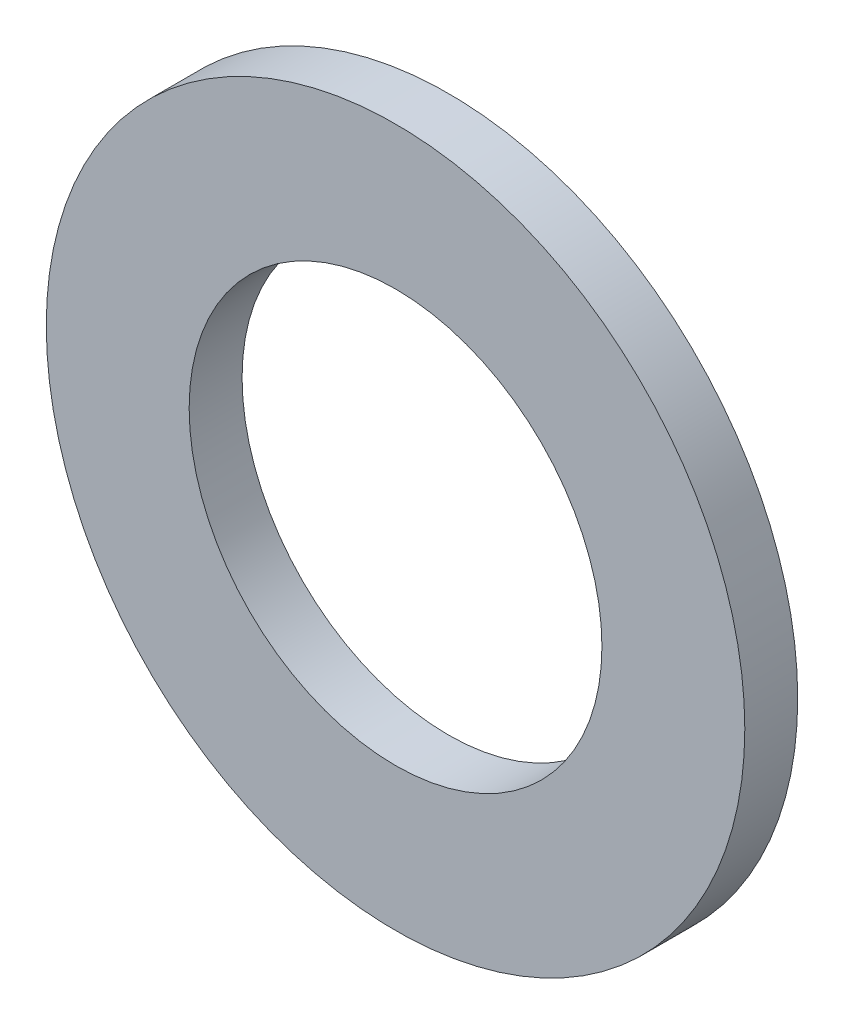
ISO-10303-21;
HEADER;
FILE_DESCRIPTION(('STEP AP214'),'2;1');
FILE_NAME('part.step','',(''),(''),'','','');
FILE_SCHEMA(('AUTOMOTIVE_DESIGN { 1 0 10303 214 1 1 1 1 }'));
ENDSEC;
DATA;
#1=APPLICATION_CONTEXT('core data for automotive mechanical design processes');
#2=APPLICATION_PROTOCOL_DEFINITION('international standard','automotive_design',2000,#1);
#3=PRODUCT_CONTEXT('',#1,'mechanical');
#4=PRODUCT('Part','Part','',(#3));
#5=PRODUCT_RELATED_PRODUCT_CATEGORY('part','',(#4));
#6=PRODUCT_DEFINITION_FORMATION('','',#4);
#7=PRODUCT_DEFINITION_CONTEXT('part definition',#1,'design');
#8=PRODUCT_DEFINITION('design','',#6,#7);
#9=PRODUCT_DEFINITION_SHAPE('','',#8);
#10=(LENGTH_UNIT() NAMED_UNIT(*) SI_UNIT(.MILLI.,.METRE.));
#11=(NAMED_UNIT(*) PLANE_ANGLE_UNIT() SI_UNIT($,.RADIAN.));
#12=(NAMED_UNIT(*) SI_UNIT($,.STERADIAN.) SOLID_ANGLE_UNIT());
#13=UNCERTAINTY_MEASURE_WITH_UNIT(LENGTH_MEASURE(1.E-05),#10,'distance_accuracy_value','');
#14=(GEOMETRIC_REPRESENTATION_CONTEXT(3) GLOBAL_UNCERTAINTY_ASSIGNED_CONTEXT((#13)) GLOBAL_UNIT_ASSIGNED_CONTEXT((#10,
#11,#12)) REPRESENTATION_CONTEXT('',''));
#15=CARTESIAN_POINT('',(0.,0.,0.));
#16=DIRECTION('',(0.,0.,1.));
#17=DIRECTION('',(1.,0.,0.));
#18=AXIS2_PLACEMENT_3D('',#15,#16,#17);
#19=CARTESIAN_POINT('',(0.,0.,5.));
#20=DIRECTION('',(0.,0.,1.));
#21=DIRECTION('',(1.,0.,0.));
#22=AXIS2_PLACEMENT_3D('',#19,#20,#21);
#23=PLANE('',#22);
#24=CARTESIAN_POINT('',(0.,0.,5.));
#25=DIRECTION('',(0.,0.,1.));
#26=DIRECTION('',(1.,0.,0.));
#27=AXIS2_PLACEMENT_3D('',#24,#25,#26);
#28=CIRCLE('',#27,33.);
#29=CARTESIAN_POINT('',(33.,0.,5.));
#30=VERTEX_POINT('',#29);
#31=EDGE_CURVE('E10',#30,#30,#28,.T.);
#32=ORIENTED_EDGE('',*,*,#31,.T.);
#33=EDGE_LOOP('',(#32));
#34=FACE_BOUND('',#33,.T.);
#35=CARTESIAN_POINT('',(0.,0.,5.));
#36=DIRECTION('',(0.,0.,1.));
#37=DIRECTION('',(1.,0.,0.));
#38=AXIS2_PLACEMENT_3D('',#35,#36,#37);
#39=CIRCLE('',#38,19.5);
#40=CARTESIAN_POINT('',(19.5,0.,5.));
#41=VERTEX_POINT('',#40);
#42=EDGE_CURVE('E41',#41,#41,#39,.T.);
#43=ORIENTED_EDGE('',*,*,#42,.F.);
#44=EDGE_LOOP('',(#43));
#45=FACE_BOUND('',#44,.T.);
#46=ADVANCED_FACE('F30',(#34,#45),#23,.T.);
#47=CARTESIAN_POINT('',(0.,0.,0.));
#48=DIRECTION('',(0.,0.,1.));
#49=DIRECTION('',(1.,0.,0.));
#50=AXIS2_PLACEMENT_3D('',#47,#48,#49);
#51=PLANE('',#50);
#52=CARTESIAN_POINT('',(0.,0.,0.));
#53=DIRECTION('',(0.,0.,1.));
#54=DIRECTION('',(1.,0.,0.));
#55=AXIS2_PLACEMENT_3D('',#52,#53,#54);
#56=CIRCLE('',#55,33.);
#57=CARTESIAN_POINT('',(33.,0.,0.));
#58=VERTEX_POINT('',#57);
#59=EDGE_CURVE('E34',#58,#58,#56,.T.);
#60=ORIENTED_EDGE('',*,*,#59,.F.);
#61=EDGE_LOOP('',(#60));
#62=FACE_BOUND('',#61,.T.);
#63=CARTESIAN_POINT('',(0.,0.,0.));
#64=DIRECTION('',(0.,0.,1.));
#65=DIRECTION('',(1.,0.,0.));
#66=AXIS2_PLACEMENT_3D('',#63,#64,#65);
#67=CIRCLE('',#66,19.5);
#68=CARTESIAN_POINT('',(19.5,0.,0.));
#69=VERTEX_POINT('',#68);
#70=EDGE_CURVE('E43',#69,#69,#67,.T.);
#71=ORIENTED_EDGE('',*,*,#70,.T.);
#72=EDGE_LOOP('',(#71));
#73=FACE_BOUND('',#72,.T.);
#74=ADVANCED_FACE('F53',(#62,#73),#51,.F.);
#75=CARTESIAN_POINT('',(0.,0.,5.));
#76=DIRECTION('',(0.,0.,-1.));
#77=DIRECTION('',(-1.,0.,0.));
#78=AXIS2_PLACEMENT_3D('',#75,#76,#77);
#79=CYLINDRICAL_SURFACE('',#78,33.);
#80=ORIENTED_EDGE('',*,*,#31,.F.);
#81=EDGE_LOOP('',(#80));
#82=FACE_BOUND('',#81,.T.);
#83=ORIENTED_EDGE('',*,*,#59,.T.);
#84=EDGE_LOOP('',(#83));
#85=FACE_BOUND('',#84,.T.);
#86=ADVANCED_FACE('F32',(#82,#85),#79,.T.);
#87=CARTESIAN_POINT('',(0.,0.,5.));
#88=DIRECTION('',(0.,0.,-1.));
#89=DIRECTION('',(-1.,0.,0.));
#90=AXIS2_PLACEMENT_3D('',#87,#88,#89);
#91=CYLINDRICAL_SURFACE('',#90,19.5);
#92=ORIENTED_EDGE('',*,*,#42,.T.);
#93=EDGE_LOOP('',(#92));
#94=FACE_BOUND('',#93,.T.);
#95=ORIENTED_EDGE('',*,*,#70,.F.);
#96=EDGE_LOOP('',(#95));
#97=FACE_BOUND('',#96,.T.);
#98=ADVANCED_FACE('F49',(#94,#97),#91,.F.);
#99=CLOSED_SHELL('',(#46,#74,#86,#98));
#100=MANIFOLD_SOLID_BREP('B2',#99);
#101=ADVANCED_BREP_SHAPE_REPRESENTATION('',(#18,#100),#14);
#102=SHAPE_DEFINITION_REPRESENTATION(#9,#101);
ENDSEC;
END-ISO-10303-21;
